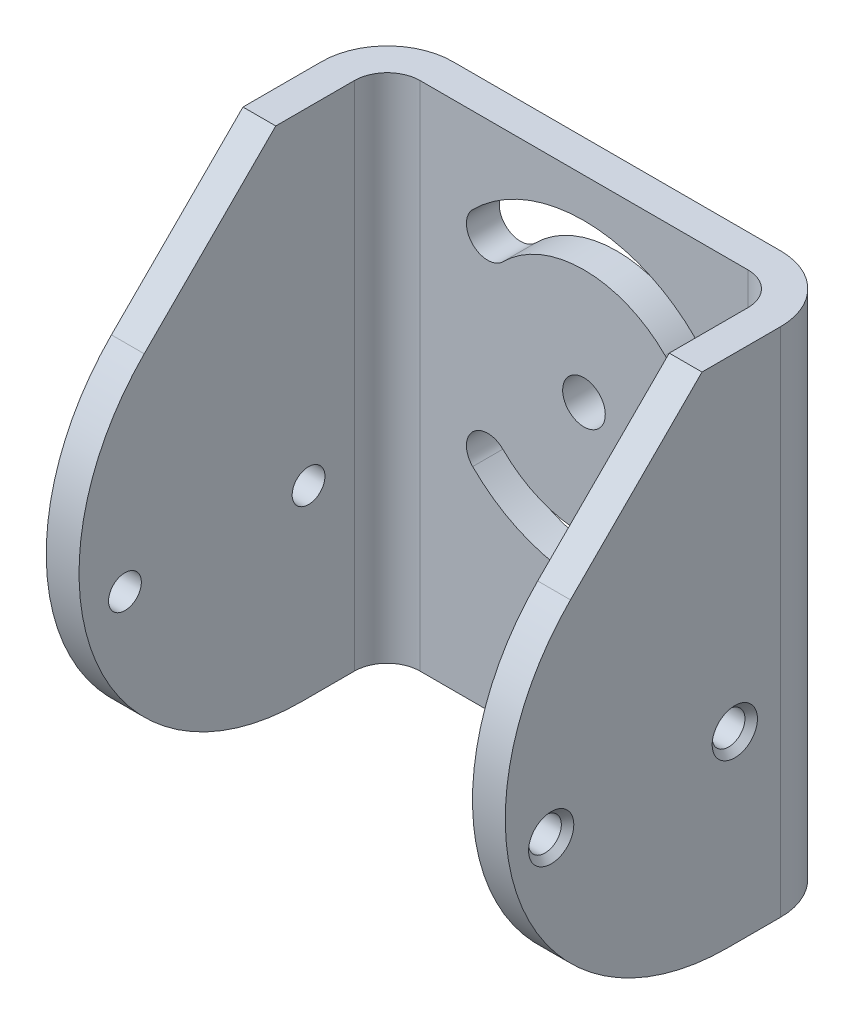
ISO-10303-21;
HEADER;
FILE_DESCRIPTION(('STEP AP214'),'2;1');
FILE_NAME('part.step','',(''),(''),'','','');
FILE_SCHEMA(('AUTOMOTIVE_DESIGN { 1 0 10303 214 1 1 1 1 }'));
ENDSEC;
DATA;
#1=APPLICATION_CONTEXT('core data for automotive mechanical design processes');
#2=APPLICATION_PROTOCOL_DEFINITION('international standard','automotive_design',2000,#1);
#3=PRODUCT_CONTEXT('',#1,'mechanical');
#4=PRODUCT('Part','Part','',(#3));
#5=PRODUCT_RELATED_PRODUCT_CATEGORY('part','',(#4));
#6=PRODUCT_DEFINITION_FORMATION('','',#4);
#7=PRODUCT_DEFINITION_CONTEXT('part definition',#1,'design');
#8=PRODUCT_DEFINITION('design','',#6,#7);
#9=PRODUCT_DEFINITION_SHAPE('','',#8);
#10=(LENGTH_UNIT() NAMED_UNIT(*) SI_UNIT(.MILLI.,.METRE.));
#11=(NAMED_UNIT(*) PLANE_ANGLE_UNIT() SI_UNIT($,.RADIAN.));
#12=(NAMED_UNIT(*) SI_UNIT($,.STERADIAN.) SOLID_ANGLE_UNIT());
#13=UNCERTAINTY_MEASURE_WITH_UNIT(LENGTH_MEASURE(1.E-05),#10,'distance_accuracy_value','');
#14=(GEOMETRIC_REPRESENTATION_CONTEXT(3) GLOBAL_UNCERTAINTY_ASSIGNED_CONTEXT((#13)) GLOBAL_UNIT_ASSIGNED_CONTEXT((#10,
#11,#12)) REPRESENTATION_CONTEXT('',''));
#15=CARTESIAN_POINT('',(0.,0.,0.));
#16=DIRECTION('',(0.,0.,1.));
#17=DIRECTION('',(1.,0.,0.));
#18=AXIS2_PLACEMENT_3D('',#15,#16,#17);
#19=CARTESIAN_POINT('',(35.0000002319239,-26.6874001927709,83.5000001813674));
#20=DIRECTION('',(1.,0.,0.));
#21=DIRECTION('',(0.,0.,-1.));
#22=AXIS2_PLACEMENT_3D('',#19,#20,#21);
#23=CYLINDRICAL_SURFACE('',#22,2.5);
#24=CARTESIAN_POINT('',(34.0500002318436,-26.6874001927709,83.5000001813674));
#25=DIRECTION('',(1.,0.,0.));
#26=DIRECTION('',(0.,-1.,0.));
#27=AXIS2_PLACEMENT_3D('',#24,#25,#26);
#28=CIRCLE('',#27,2.50000000005405);
#29=CARTESIAN_POINT('',(34.0500002318436,-29.187400192825,83.5000001813675));
#30=VERTEX_POINT('',#29);
#31=EDGE_CURVE('E286',#30,#30,#28,.T.);
#32=ORIENTED_EDGE('',*,*,#31,.T.);
#33=EDGE_LOOP('',(#32));
#34=FACE_BOUND('',#33,.T.);
#35=CARTESIAN_POINT('',(30.0000002319239,-26.6874001927709,83.5000001813674));
#36=DIRECTION('',(1.,0.,0.));
#37=DIRECTION('',(0.,0.,-1.));
#38=AXIS2_PLACEMENT_3D('',#35,#36,#37);
#39=CIRCLE('',#38,2.5);
#40=CARTESIAN_POINT('',(30.0000002319239,-26.6874001927709,81.0000001813674));
#41=VERTEX_POINT('',#40);
#42=EDGE_CURVE('E20',#41,#41,#39,.T.);
#43=ORIENTED_EDGE('',*,*,#42,.F.);
#44=EDGE_LOOP('',(#43));
#45=FACE_BOUND('',#44,.T.);
#46=ADVANCED_FACE('F17',(#34,#45),#23,.F.);
#47=CARTESIAN_POINT('',(35.0000002319239,-26.6874001927709,111.500000181367));
#48=DIRECTION('',(1.,0.,0.));
#49=DIRECTION('',(0.,0.,-1.));
#50=AXIS2_PLACEMENT_3D('',#47,#48,#49);
#51=CYLINDRICAL_SURFACE('',#50,2.5);
#52=CARTESIAN_POINT('',(34.0500002318436,-26.6874001927709,111.500000181367));
#53=DIRECTION('',(1.,0.,0.));
#54=DIRECTION('',(0.,-1.,0.));
#55=AXIS2_PLACEMENT_3D('',#52,#53,#54);
#56=CIRCLE('',#55,2.50000000005405);
#57=CARTESIAN_POINT('',(34.0500002318436,-29.187400192825,111.500000181367));
#58=VERTEX_POINT('',#57);
#59=EDGE_CURVE('E292',#58,#58,#56,.T.);
#60=ORIENTED_EDGE('',*,*,#59,.T.);
#61=EDGE_LOOP('',(#60));
#62=FACE_BOUND('',#61,.T.);
#63=CARTESIAN_POINT('',(30.0000002319239,-26.6874001927709,111.500000181367));
#64=DIRECTION('',(1.,0.,0.));
#65=DIRECTION('',(0.,0.,-1.));
#66=AXIS2_PLACEMENT_3D('',#63,#64,#65);
#67=CIRCLE('',#66,2.5);
#68=CARTESIAN_POINT('',(30.0000002319239,-26.6874001927709,109.000000181367));
#69=VERTEX_POINT('',#68);
#70=EDGE_CURVE('E153',#69,#69,#67,.T.);
#71=ORIENTED_EDGE('',*,*,#70,.F.);
#72=EDGE_LOOP('',(#71));
#73=FACE_BOUND('',#72,.T.);
#74=ADVANCED_FACE('F376',(#62,#73),#51,.F.);
#75=CARTESIAN_POINT('',(-34.9999997680761,-26.6874001927709,83.5000001813674));
#76=DIRECTION('',(-1.,0.,0.));
#77=DIRECTION('',(0.,0.,1.));
#78=AXIS2_PLACEMENT_3D('',#75,#76,#77);
#79=CYLINDRICAL_SURFACE('',#78,2.5);
#80=CARTESIAN_POINT('',(-34.0499997680581,-26.6874001927709,83.5000001813674));
#81=DIRECTION('',(-1.,0.,0.));
#82=DIRECTION('',(0.,1.,0.));
#83=AXIS2_PLACEMENT_3D('',#80,#81,#82);
#84=CIRCLE('',#83,2.4999999999414);
#85=CARTESIAN_POINT('',(-34.0499997680581,-24.1874001928295,83.5000001813673));
#86=VERTEX_POINT('',#85);
#87=EDGE_CURVE('E295',#86,#86,#84,.T.);
#88=ORIENTED_EDGE('',*,*,#87,.T.);
#89=EDGE_LOOP('',(#88));
#90=FACE_BOUND('',#89,.T.);
#91=CARTESIAN_POINT('',(-29.9999997680761,-26.6874001927709,83.5000001813674));
#92=DIRECTION('',(-1.,0.,0.));
#93=DIRECTION('',(0.,0.,1.));
#94=AXIS2_PLACEMENT_3D('',#91,#92,#93);
#95=CIRCLE('',#94,2.5);
#96=CARTESIAN_POINT('',(-29.9999997680761,-26.6874001927709,86.0000001813674));
#97=VERTEX_POINT('',#96);
#98=EDGE_CURVE('E270',#97,#97,#95,.T.);
#99=ORIENTED_EDGE('',*,*,#98,.F.);
#100=EDGE_LOOP('',(#99));
#101=FACE_BOUND('',#100,.T.);
#102=ADVANCED_FACE('F382',(#90,#101),#79,.F.);
#103=CARTESIAN_POINT('',(-34.9999997680761,-26.6874001927709,111.500000181367));
#104=DIRECTION('',(-1.,0.,0.));
#105=DIRECTION('',(0.,0.,1.));
#106=AXIS2_PLACEMENT_3D('',#103,#104,#105);
#107=CYLINDRICAL_SURFACE('',#106,2.5);
#108=CARTESIAN_POINT('',(-34.0499997680581,-26.6874001927709,111.500000181367));
#109=DIRECTION('',(-1.,0.,0.));
#110=DIRECTION('',(0.,1.,0.));
#111=AXIS2_PLACEMENT_3D('',#108,#109,#110);
#112=CIRCLE('',#111,2.4999999999414);
#113=CARTESIAN_POINT('',(-34.0499997680581,-24.1874001928295,111.500000181367));
#114=VERTEX_POINT('',#113);
#115=EDGE_CURVE('E298',#114,#114,#112,.T.);
#116=ORIENTED_EDGE('',*,*,#115,.T.);
#117=EDGE_LOOP('',(#116));
#118=FACE_BOUND('',#117,.T.);
#119=CARTESIAN_POINT('',(-29.9999997680761,-26.6874001927709,111.500000181367));
#120=DIRECTION('',(-1.,0.,0.));
#121=DIRECTION('',(0.,0.,1.));
#122=AXIS2_PLACEMENT_3D('',#119,#120,#121);
#123=CIRCLE('',#122,2.5);
#124=CARTESIAN_POINT('',(-29.9999997680761,-26.6874001927709,114.000000181367));
#125=VERTEX_POINT('',#124);
#126=EDGE_CURVE('E266',#125,#125,#123,.T.);
#127=ORIENTED_EDGE('',*,*,#126,.F.);
#128=EDGE_LOOP('',(#127));
#129=FACE_BOUND('',#128,.T.);
#130=ADVANCED_FACE('F497',(#118,#129),#107,.F.);
#131=CARTESIAN_POINT('',(-34.9999997681039,-26.6874001927709,111.500000181367));
#132=DIRECTION('',(-1.,0.,0.));
#133=DIRECTION('',(0.,0.,1.));
#134=AXIS2_PLACEMENT_3D('',#131,#132,#133);
#135=CONICAL_SURFACE('',#134,3.44999999998715,0.785398163397448);
#136=CARTESIAN_POINT('',(-34.9999997681039,-26.6874001927709,111.500000181367));
#137=DIRECTION('',(-1.,0.,0.));
#138=DIRECTION('',(0.,0.,1.));
#139=AXIS2_PLACEMENT_3D('',#136,#137,#138);
#140=CIRCLE('',#139,3.44999999998715);
#141=CARTESIAN_POINT('',(-34.9999997681039,-26.6874001927709,114.950000181354));
#142=VERTEX_POINT('',#141);
#143=EDGE_CURVE('E289',#142,#142,#140,.F.);
#144=ORIENTED_EDGE('',*,*,#143,.F.);
#145=EDGE_LOOP('',(#144));
#146=FACE_BOUND('',#145,.T.);
#147=ORIENTED_EDGE('',*,*,#115,.F.);
#148=EDGE_LOOP('',(#147));
#149=FACE_BOUND('',#148,.T.);
#150=ADVANCED_FACE('F493',(#146,#149),#135,.F.);
#151=CARTESIAN_POINT('',(-34.9999997681039,-26.6874001927709,83.5000001813674));
#152=DIRECTION('',(-1.,0.,0.));
#153=DIRECTION('',(0.,0.,1.));
#154=AXIS2_PLACEMENT_3D('',#151,#152,#153);
#155=CONICAL_SURFACE('',#154,3.44999999998715,0.785398163397448);
#156=CARTESIAN_POINT('',(-34.9999997681039,-26.6874001927709,83.5000001813674));
#157=DIRECTION('',(-1.,0.,0.));
#158=DIRECTION('',(0.,0.,1.));
#159=AXIS2_PLACEMENT_3D('',#156,#157,#158);
#160=CIRCLE('',#159,3.44999999998715);
#161=CARTESIAN_POINT('',(-34.9999997681039,-26.6874001927709,86.9500001813545));
#162=VERTEX_POINT('',#161);
#163=EDGE_CURVE('E359',#162,#162,#160,.F.);
#164=ORIENTED_EDGE('',*,*,#163,.F.);
#165=EDGE_LOOP('',(#164));
#166=FACE_BOUND('',#165,.T.);
#167=ORIENTED_EDGE('',*,*,#87,.F.);
#168=EDGE_LOOP('',(#167));
#169=FACE_BOUND('',#168,.T.);
#170=ADVANCED_FACE('F489',(#166,#169),#155,.F.);
#171=CARTESIAN_POINT('',(35.0000002317756,-26.6874001927709,111.500000181367));
#172=DIRECTION('',(1.,0.,0.));
#173=DIRECTION('',(0.,0.,-1.));
#174=AXIS2_PLACEMENT_3D('',#171,#172,#173);
#175=CONICAL_SURFACE('',#174,3.44999999998611,0.785398163397448);
#176=ORIENTED_EDGE('',*,*,#59,.F.);
#177=EDGE_LOOP('',(#176));
#178=FACE_BOUND('',#177,.T.);
#179=CARTESIAN_POINT('',(35.0000002318893,-26.6874001927709,111.500000181367));
#180=DIRECTION('',(1.,0.,0.));
#181=DIRECTION('',(0.,0.,-1.));
#182=AXIS2_PLACEMENT_3D('',#179,#180,#181);
#183=CIRCLE('',#182,3.4500000000998);
#184=CARTESIAN_POINT('',(35.0000002318893,-26.6874001927709,108.050000181267));
#185=VERTEX_POINT('',#184);
#186=EDGE_CURVE('E251',#185,#185,#183,.F.);
#187=ORIENTED_EDGE('',*,*,#186,.F.);
#188=EDGE_LOOP('',(#187));
#189=FACE_BOUND('',#188,.T.);
#190=ADVANCED_FACE('F485',(#178,#189),#175,.F.);
#191=CARTESIAN_POINT('',(35.0000002317756,-26.6874001927709,83.5000001813674));
#192=DIRECTION('',(1.,0.,0.));
#193=DIRECTION('',(0.,0.,-1.));
#194=AXIS2_PLACEMENT_3D('',#191,#192,#193);
#195=CONICAL_SURFACE('',#194,3.44999999998611,0.785398163397448);
#196=ORIENTED_EDGE('',*,*,#31,.F.);
#197=EDGE_LOOP('',(#196));
#198=FACE_BOUND('',#197,.T.);
#199=CARTESIAN_POINT('',(35.0000002318893,-26.6874001927709,83.5000001813674));
#200=DIRECTION('',(1.,0.,0.));
#201=DIRECTION('',(0.,0.,-1.));
#202=AXIS2_PLACEMENT_3D('',#199,#200,#201);
#203=CIRCLE('',#202,3.4500000000998);
#204=CARTESIAN_POINT('',(35.0000002318893,-26.6874001927709,80.0500001812676));
#205=VERTEX_POINT('',#204);
#206=EDGE_CURVE('E244',#205,#205,#203,.F.);
#207=ORIENTED_EDGE('',*,*,#206,.F.);
#208=EDGE_LOOP('',(#207));
#209=FACE_BOUND('',#208,.T.);
#210=ADVANCED_FACE('F481',(#198,#209),#195,.F.);
#211=CARTESIAN_POINT('',(-32.4999997680761,8.31259980722917,103.500000181367));
#212=DIRECTION('',(0.,0.707106781186564,0.707106781186531));
#213=DIRECTION('',(0.,-0.707106781186531,0.707106781186564));
#214=AXIS2_PLACEMENT_3D('',#211,#212,#213);
#215=PLANE('',#214);
#216=DIRECTION('',(1.,0.,0.));
#217=VECTOR('',#216,1.);
#218=CARTESIAN_POINT('',(-39.9999997680761,23.3125998072288,88.5000001813665));
#219=LINE('',#218,#217);
#220=CARTESIAN_POINT('',(-34.9999997680761,23.3125998072288,88.5000001813665));
#221=VERTEX_POINT('',#220);
#222=CARTESIAN_POINT('',(-29.9999997680761,23.3125998072287,88.5000001813666));
#223=VERTEX_POINT('',#222);
#224=EDGE_CURVE('E197',#221,#223,#219,.T.);
#225=ORIENTED_EDGE('',*,*,#224,.F.);
#226=DIRECTION('',(0.,0.707106781186527,-0.707106781186568));
#227=VECTOR('',#226,1.);
#228=CARTESIAN_POINT('',(-34.9999997680761,3.25372530418349,108.558874684413));
#229=LINE('',#228,#227);
#230=CARTESIAN_POINT('',(-34.9999997680761,3.2537253041836,108.558874684413));
#231=VERTEX_POINT('',#230);
#232=EDGE_CURVE('E248',#231,#221,#229,.T.);
#233=ORIENTED_EDGE('',*,*,#232,.F.);
#234=DIRECTION('',(-1.,0.,0.));
#235=VECTOR('',#234,1.);
#236=CARTESIAN_POINT('',(-34.9999997680761,3.25372530418336,108.558874684413));
#237=LINE('',#236,#235);
#238=CARTESIAN_POINT('',(-29.9999997680761,3.25372530418361,108.558874684413));
#239=VERTEX_POINT('',#238);
#240=EDGE_CURVE('E287',#239,#231,#237,.T.);
#241=ORIENTED_EDGE('',*,*,#240,.F.);
#242=DIRECTION('',(0.,-0.707106781186527,0.707106781186568));
#243=VECTOR('',#242,1.);
#244=CARTESIAN_POINT('',(-29.9999997680761,23.3125998072288,88.5000001813665));
#245=LINE('',#244,#243);
#246=EDGE_CURVE('E259',#223,#239,#245,.T.);
#247=ORIENTED_EDGE('',*,*,#246,.F.);
#248=EDGE_LOOP('',(#225,#233,#241,#247));
#249=FACE_BOUND('',#248,.T.);
#250=ADVANCED_FACE('F477',(#249),#215,.T.);
#251=CARTESIAN_POINT('',(32.5000002319239,8.31259980722917,103.500000181367));
#252=DIRECTION('',(0.,0.707106781186564,0.707106781186531));
#253=DIRECTION('',(0.,-0.707106781186531,0.707106781186564));
#254=AXIS2_PLACEMENT_3D('',#251,#252,#253);
#255=PLANE('',#254);
#256=DIRECTION('',(1.,0.,0.));
#257=VECTOR('',#256,1.);
#258=CARTESIAN_POINT('',(-39.9999997680761,23.3125998072288,88.5000001813665));
#259=LINE('',#258,#257);
#260=CARTESIAN_POINT('',(30.0000002319239,23.3125998072288,88.5000001813665));
#261=VERTEX_POINT('',#260);
#262=CARTESIAN_POINT('',(35.0000002319239,23.3125998072287,88.5000001813666));
#263=VERTEX_POINT('',#262);
#264=EDGE_CURVE('E181',#261,#263,#259,.T.);
#265=ORIENTED_EDGE('',*,*,#264,.F.);
#266=DIRECTION('',(0.,0.707106781186526,-0.707106781186569));
#267=VECTOR('',#266,1.);
#268=CARTESIAN_POINT('',(30.0000002319239,3.25372530418349,108.558874684413));
#269=LINE('',#268,#267);
#270=CARTESIAN_POINT('',(30.0000002319239,3.25372530418363,108.558874684413));
#271=VERTEX_POINT('',#270);
#272=EDGE_CURVE('E152',#271,#261,#269,.T.);
#273=ORIENTED_EDGE('',*,*,#272,.F.);
#274=DIRECTION('',(-1.,0.,0.));
#275=VECTOR('',#274,1.);
#276=CARTESIAN_POINT('',(-34.9999997680761,3.2537253041834,108.558874684413));
#277=LINE('',#276,#275);
#278=CARTESIAN_POINT('',(35.0000002319239,3.25372530418368,108.558874684413));
#279=VERTEX_POINT('',#278);
#280=EDGE_CURVE('E148',#279,#271,#277,.T.);
#281=ORIENTED_EDGE('',*,*,#280,.F.);
#282=DIRECTION('',(0.,-0.707106781186525,0.70710678118657));
#283=VECTOR('',#282,1.);
#284=CARTESIAN_POINT('',(35.0000002319239,23.3125998072288,88.5000001813665));
#285=LINE('',#284,#283);
#286=EDGE_CURVE('E241',#263,#279,#285,.T.);
#287=ORIENTED_EDGE('',*,*,#286,.F.);
#288=EDGE_LOOP('',(#265,#273,#281,#287));
#289=FACE_BOUND('',#288,.T.);
#290=ADVANCED_FACE('F474',(#289),#255,.T.);
#291=CARTESIAN_POINT('',(-34.9999997680761,-20.746274695817,84.5588746844132));
#292=DIRECTION('',(-1.,0.,0.));
#293=DIRECTION('',(0.,0.,1.));
#294=AXIS2_PLACEMENT_3D('',#291,#292,#293);
#295=CYLINDRICAL_SURFACE('',#294,33.9411254969543);
#296=CARTESIAN_POINT('',(30.0000002319239,-20.746274695817,84.5588746844132));
#297=DIRECTION('',(-1.,0.,0.));
#298=DIRECTION('',(0.,0.,1.));
#299=AXIS2_PLACEMENT_3D('',#296,#297,#298);
#300=CIRCLE('',#299,33.9411254969543);
#301=CARTESIAN_POINT('',(30.0000002319239,-54.6874001927713,84.5588746844137));
#302=VERTEX_POINT('',#301);
#303=EDGE_CURVE('E145',#302,#271,#300,.T.);
#304=ORIENTED_EDGE('',*,*,#303,.F.);
#305=DIRECTION('',(1.,0.,0.));
#306=VECTOR('',#305,1.);
#307=CARTESIAN_POINT('',(40.0000002319239,-54.6874001927713,84.5588746844135));
#308=LINE('',#307,#306);
#309=CARTESIAN_POINT('',(35.0000002319239,-54.6874001927713,84.5588746844137));
#310=VERTEX_POINT('',#309);
#311=EDGE_CURVE('E132',#310,#302,#308,.F.);
#312=ORIENTED_EDGE('',*,*,#311,.F.);
#313=CARTESIAN_POINT('',(35.0000002319239,-20.746274695817,84.5588746844132));
#314=DIRECTION('',(-1.,0.,0.));
#315=DIRECTION('',(0.,0.,1.));
#316=AXIS2_PLACEMENT_3D('',#313,#314,#315);
#317=CIRCLE('',#316,33.9411254969543);
#318=EDGE_CURVE('E243',#279,#310,#317,.F.);
#319=ORIENTED_EDGE('',*,*,#318,.F.);
#320=ORIENTED_EDGE('',*,*,#280,.T.);
#321=EDGE_LOOP('',(#304,#312,#319,#320));
#322=FACE_BOUND('',#321,.T.);
#323=ADVANCED_FACE('F146',(#322),#295,.T.);
#324=CARTESIAN_POINT('',(30.0000002319239,-46.6874001927716,71.5000001813681));
#325=DIRECTION('',(-1.,0.,0.));
#326=DIRECTION('',(0.,0.,1.));
#327=AXIS2_PLACEMENT_3D('',#324,#325,#326);
#328=PLANE('',#327);
#329=ORIENTED_EDGE('',*,*,#272,.T.);
#330=DIRECTION('',(0.,0.,1.));
#331=VECTOR('',#330,1.);
#332=CARTESIAN_POINT('',(30.0000002319239,23.3125998072283,66.5000001813665));
#333=LINE('',#332,#331);
#334=CARTESIAN_POINT('',(30.0000002319239,23.3125998072285,76.5000001813665));
#335=VERTEX_POINT('',#334);
#336=EDGE_CURVE('E184',#335,#261,#333,.T.);
#337=ORIENTED_EDGE('',*,*,#336,.F.);
#338=DIRECTION('',(0.,-1.,0.));
#339=VECTOR('',#338,1.);
#340=CARTESIAN_POINT('',(30.0000002319239,19.7587662931992,76.5000001813666));
#341=LINE('',#340,#339);
#342=CARTESIAN_POINT('',(30.0000002319239,-54.6874001927714,76.5000001813683));
#343=VERTEX_POINT('',#342);
#344=EDGE_CURVE('E158',#335,#343,#341,.T.);
#345=ORIENTED_EDGE('',*,*,#344,.T.);
#346=DIRECTION('',(0.,0.,-1.));
#347=VECTOR('',#346,1.);
#348=CARTESIAN_POINT('',(30.0000002319239,-54.6874001927717,66.5000001813683));
#349=LINE('',#348,#347);
#350=EDGE_CURVE('E136',#302,#343,#349,.T.);
#351=ORIENTED_EDGE('',*,*,#350,.F.);
#352=ORIENTED_EDGE('',*,*,#303,.T.);
#353=EDGE_LOOP('',(#329,#337,#345,#351,#352));
#354=FACE_BOUND('',#353,.T.);
#355=ORIENTED_EDGE('',*,*,#70,.T.);
#356=EDGE_LOOP('',(#355));
#357=FACE_BOUND('',#356,.T.);
#358=ORIENTED_EDGE('',*,*,#42,.T.);
#359=EDGE_LOOP('',(#358));
#360=FACE_BOUND('',#359,.T.);
#361=ADVANCED_FACE('F155',(#354,#357,#360),#328,.T.);
#362=CARTESIAN_POINT('',(25.0000002319239,19.7587662931992,76.5000001813666));
#363=DIRECTION('',(0.,-1.,0.));
#364=DIRECTION('',(0.,0.,-1.));
#365=AXIS2_PLACEMENT_3D('',#362,#363,#364);
#366=CYLINDRICAL_SURFACE('',#365,5.);
#367=CARTESIAN_POINT('',(25.0000002319239,-54.6874001927714,76.5000001813683));
#368=DIRECTION('',(0.,-1.,0.));
#369=DIRECTION('',(0.,0.,-1.));
#370=AXIS2_PLACEMENT_3D('',#367,#368,#369);
#371=CIRCLE('',#370,5.);
#372=CARTESIAN_POINT('',(25.0000002319239,-54.6874001927716,71.5000001813682));
#373=VERTEX_POINT('',#372);
#374=EDGE_CURVE('E160',#343,#373,#371,.F.);
#375=ORIENTED_EDGE('',*,*,#374,.F.);
#376=ORIENTED_EDGE('',*,*,#344,.F.);
#377=CARTESIAN_POINT('',(25.0000002319239,23.3125998072285,76.5000001813665));
#378=DIRECTION('',(0.,-1.,0.));
#379=DIRECTION('',(0.,0.,-1.));
#380=AXIS2_PLACEMENT_3D('',#377,#378,#379);
#381=CIRCLE('',#380,5.);
#382=CARTESIAN_POINT('',(25.0000002319239,23.3125998072284,71.5000001813665));
#383=VERTEX_POINT('',#382);
#384=EDGE_CURVE('E187',#383,#335,#381,.T.);
#385=ORIENTED_EDGE('',*,*,#384,.F.);
#386=DIRECTION('',(0.,-1.,0.));
#387=VECTOR('',#386,1.);
#388=CARTESIAN_POINT('',(25.0000002319239,2.72541331255883,71.5000001813669));
#389=LINE('',#388,#387);
#390=EDGE_CURVE('E271',#373,#383,#389,.F.);
#391=ORIENTED_EDGE('',*,*,#390,.F.);
#392=EDGE_LOOP('',(#375,#376,#385,#391));
#393=FACE_BOUND('',#392,.T.);
#394=ADVANCED_FACE('F465',(#393),#366,.F.);
#395=CARTESIAN_POINT('',(16.382976663996,2.72541331255883,71.5000001813669));
#396=DIRECTION('',(0.,0.,1.));
#397=DIRECTION('',(0.,-1.,0.));
#398=AXIS2_PLACEMENT_3D('',#395,#396,#397);
#399=PLANE('',#398);
#400=DIRECTION('',(0.,1.,0.));
#401=VECTOR('',#400,1.);
#402=CARTESIAN_POINT('',(-24.9999997680761,19.7587662931991,71.5000001813666));
#403=LINE('',#402,#401);
#404=CARTESIAN_POINT('',(-24.9999997680761,23.3125998072284,71.5000001813665));
#405=VERTEX_POINT('',#404);
#406=CARTESIAN_POINT('',(-24.9999997680761,-54.6874001927716,71.5000001813683));
#407=VERTEX_POINT('',#406);
#408=EDGE_CURVE('E267',#405,#407,#403,.F.);
#409=ORIENTED_EDGE('',*,*,#408,.T.);
#410=DIRECTION('',(1.,0.,0.));
#411=VECTOR('',#410,1.);
#412=CARTESIAN_POINT('',(40.0000002319239,-54.6874001927716,71.5000001813683));
#413=LINE('',#412,#411);
#414=EDGE_CURVE('E162',#373,#407,#413,.F.);
#415=ORIENTED_EDGE('',*,*,#414,.F.);
#416=ORIENTED_EDGE('',*,*,#390,.T.);
#417=DIRECTION('',(1.,0.,0.));
#418=VECTOR('',#417,1.);
#419=CARTESIAN_POINT('',(-39.9999997680761,23.3125998072284,71.5000001813665));
#420=LINE('',#419,#418);
#421=EDGE_CURVE('E190',#405,#383,#420,.T.);
#422=ORIENTED_EDGE('',*,*,#421,.F.);
#423=EDGE_LOOP('',(#409,#415,#416,#422));
#424=FACE_BOUND('',#423,.T.);
#425=CARTESIAN_POINT('',(2.31923896976127E-07,-6.68740019277157,71.5000001813672));
#426=DIRECTION('',(0.,0.,1.));
#427=DIRECTION('',(0.,-1.,0.));
#428=AXIS2_PLACEMENT_3D('',#425,#426,#427);
#429=CIRCLE('',#428,24.);
#430=CARTESIAN_POINT('',(16.9705629804011,-23.6579629412487,71.5000001813676));
#431=VERTEX_POINT('',#430);
#432=CARTESIAN_POINT('',(-16.9705625165533,-23.6579629412487,71.5000001813676));
#433=VERTEX_POINT('',#432);
#434=EDGE_CURVE('E237',#431,#433,#429,.F.);
#435=ORIENTED_EDGE('',*,*,#434,.T.);
#436=CARTESIAN_POINT('',(-14.672465477697,-21.3598659023924,71.5000001813675));
#437=DIRECTION('',(0.,0.,1.));
#438=DIRECTION('',(0.,-1.,0.));
#439=AXIS2_PLACEMENT_3D('',#436,#437,#438);
#440=CIRCLE('',#439,3.25);
#441=CARTESIAN_POINT('',(-12.3743684388407,-19.0617688635361,71.5000001813675));
#442=VERTEX_POINT('',#441);
#443=EDGE_CURVE('E236',#433,#442,#440,.F.);
#444=ORIENTED_EDGE('',*,*,#443,.T.);
#445=CARTESIAN_POINT('',(2.31923896976127E-07,-6.68740019277157,71.5000001813672));
#446=DIRECTION('',(0.,0.,1.));
#447=DIRECTION('',(0.,-1.,0.));
#448=AXIS2_PLACEMENT_3D('',#445,#446,#447);
#449=CIRCLE('',#448,17.5);
#450=CARTESIAN_POINT('',(12.3743689026885,-19.0617688635361,71.5000001813675));
#451=VERTEX_POINT('',#450);
#452=EDGE_CURVE('E232',#451,#442,#449,.F.);
#453=ORIENTED_EDGE('',*,*,#452,.F.);
#454=CARTESIAN_POINT('',(14.6724659415448,-21.3598659023924,71.5000001813676));
#455=DIRECTION('',(0.,0.,1.));
#456=DIRECTION('',(0.,-1.,0.));
#457=AXIS2_PLACEMENT_3D('',#454,#455,#456);
#458=CIRCLE('',#457,3.25);
#459=EDGE_CURVE('E225',#451,#431,#458,.F.);
#460=ORIENTED_EDGE('',*,*,#459,.T.);
#461=EDGE_LOOP('',(#435,#444,#453,#460));
#462=FACE_BOUND('',#461,.T.);
#463=CARTESIAN_POINT('',(14.6724659415448,7.98506551684929,71.5000001813669));
#464=DIRECTION('',(0.,0.,1.));
#465=DIRECTION('',(0.,-1.,0.));
#466=AXIS2_PLACEMENT_3D('',#463,#464,#465);
#467=CIRCLE('',#466,3.25);
#468=CARTESIAN_POINT('',(16.970562980401,10.2831625557056,71.5000001813668));
#469=VERTEX_POINT('',#468);
#470=CARTESIAN_POINT('',(12.3743689026885,5.68696847799301,71.5000001813669));
#471=VERTEX_POINT('',#470);
#472=EDGE_CURVE('E209',#469,#471,#467,.F.);
#473=ORIENTED_EDGE('',*,*,#472,.T.);
#474=CARTESIAN_POINT('',(2.31923896976127E-07,-6.68740019277157,71.5000001813672));
#475=DIRECTION('',(0.,0.,1.));
#476=DIRECTION('',(0.,-1.,0.));
#477=AXIS2_PLACEMENT_3D('',#474,#475,#476);
#478=CIRCLE('',#477,17.5);
#479=CARTESIAN_POINT('',(-12.3743684388407,5.68696847799302,71.5000001813669));
#480=VERTEX_POINT('',#479);
#481=EDGE_CURVE('E221',#480,#471,#478,.F.);
#482=ORIENTED_EDGE('',*,*,#481,.F.);
#483=CARTESIAN_POINT('',(-14.672465477697,7.9850655168493,71.5000001813668));
#484=DIRECTION('',(0.,0.,1.));
#485=DIRECTION('',(0.,-1.,0.));
#486=AXIS2_PLACEMENT_3D('',#483,#484,#485);
#487=CIRCLE('',#486,3.25);
#488=CARTESIAN_POINT('',(-16.9705625165532,10.2831625557056,71.5000001813668));
#489=VERTEX_POINT('',#488);
#490=EDGE_CURVE('E217',#480,#489,#487,.F.);
#491=ORIENTED_EDGE('',*,*,#490,.T.);
#492=CARTESIAN_POINT('',(2.31923896976127E-07,-6.68740019277157,71.5000001813672));
#493=DIRECTION('',(0.,0.,1.));
#494=DIRECTION('',(0.,-1.,0.));
#495=AXIS2_PLACEMENT_3D('',#492,#493,#494);
#496=CIRCLE('',#495,24.);
#497=EDGE_CURVE('E213',#489,#469,#496,.F.);
#498=ORIENTED_EDGE('',*,*,#497,.T.);
#499=EDGE_LOOP('',(#473,#482,#491,#498));
#500=FACE_BOUND('',#499,.T.);
#501=CARTESIAN_POINT('',(2.31923905857911E-07,-6.68740019277156,71.5000001813672));
#502=DIRECTION('',(0.,0.,1.));
#503=DIRECTION('',(0.,-1.,0.));
#504=AXIS2_PLACEMENT_3D('',#501,#502,#503);
#505=CIRCLE('',#504,3.25);
#506=CARTESIAN_POINT('',(2.31923905857911E-07,-9.93740019277156,71.5000001813672));
#507=VERTEX_POINT('',#506);
#508=EDGE_CURVE('E203',#507,#507,#505,.F.);
#509=ORIENTED_EDGE('',*,*,#508,.T.);
#510=EDGE_LOOP('',(#509));
#511=FACE_BOUND('',#510,.T.);
#512=ADVANCED_FACE('F461',(#424,#462,#500,#511),#399,.T.);
#513=CARTESIAN_POINT('',(-24.9999997680761,19.7587662931992,76.5000001813666));
#514=DIRECTION('',(0.,1.,0.));
#515=DIRECTION('',(0.,0.,1.));
#516=AXIS2_PLACEMENT_3D('',#513,#514,#515);
#517=CYLINDRICAL_SURFACE('',#516,5.);
#518=CARTESIAN_POINT('',(-24.9999997680761,23.3125998072286,76.5000001813665));
#519=DIRECTION('',(0.,1.,0.));
#520=DIRECTION('',(0.,0.,1.));
#521=AXIS2_PLACEMENT_3D('',#518,#519,#520);
#522=CIRCLE('',#521,5.);
#523=CARTESIAN_POINT('',(-29.9999997680761,23.3125998072286,76.5000001813674));
#524=VERTEX_POINT('',#523);
#525=EDGE_CURVE('E193',#524,#405,#522,.F.);
#526=ORIENTED_EDGE('',*,*,#525,.F.);
#527=DIRECTION('',(0.,1.,0.));
#528=VECTOR('',#527,1.);
#529=CARTESIAN_POINT('',(-29.9999997680761,33.3125998072284,76.5000001813683));
#530=LINE('',#529,#528);
#531=CARTESIAN_POINT('',(-29.9999997680761,-54.6874001927715,76.5000001813683));
#532=VERTEX_POINT('',#531);
#533=EDGE_CURVE('E262',#532,#524,#530,.T.);
#534=ORIENTED_EDGE('',*,*,#533,.F.);
#535=CARTESIAN_POINT('',(-24.9999997680761,-54.6874001927715,76.5000001813683));
#536=DIRECTION('',(0.,1.,0.));
#537=DIRECTION('',(0.,0.,1.));
#538=AXIS2_PLACEMENT_3D('',#535,#536,#537);
#539=CIRCLE('',#538,5.);
#540=EDGE_CURVE('E332',#407,#532,#539,.T.);
#541=ORIENTED_EDGE('',*,*,#540,.F.);
#542=ORIENTED_EDGE('',*,*,#408,.F.);
#543=EDGE_LOOP('',(#526,#534,#541,#542));
#544=FACE_BOUND('',#543,.T.);
#545=ADVANCED_FACE('F457',(#544),#517,.F.);
#546=CARTESIAN_POINT('',(-29.9999997680761,33.3125998072284,71.5000001813662));
#547=DIRECTION('',(1.,0.,0.));
#548=DIRECTION('',(0.,0.,-1.));
#549=AXIS2_PLACEMENT_3D('',#546,#547,#548);
#550=PLANE('',#549);
#551=CARTESIAN_POINT('',(-29.9999997680761,-20.746274695817,84.5588746844132));
#552=DIRECTION('',(-1.,0.,0.));
#553=DIRECTION('',(0.,0.,1.));
#554=AXIS2_PLACEMENT_3D('',#551,#552,#553);
#555=CIRCLE('',#554,33.9411254969543);
#556=CARTESIAN_POINT('',(-29.9999997680761,-54.6874001927713,84.5588746844137));
#557=VERTEX_POINT('',#556);
#558=EDGE_CURVE('E261',#557,#239,#555,.T.);
#559=ORIENTED_EDGE('',*,*,#558,.F.);
#560=DIRECTION('',(0.,0.,-1.));
#561=VECTOR('',#560,1.);
#562=CARTESIAN_POINT('',(-29.9999997680761,-54.6874001927717,66.5000001813683));
#563=LINE('',#562,#561);
#564=EDGE_CURVE('E258',#532,#557,#563,.F.);
#565=ORIENTED_EDGE('',*,*,#564,.F.);
#566=ORIENTED_EDGE('',*,*,#533,.T.);
#567=DIRECTION('',(0.,0.,1.));
#568=VECTOR('',#567,1.);
#569=CARTESIAN_POINT('',(-29.9999997680761,23.3125998072283,66.5000001813665));
#570=LINE('',#569,#568);
#571=EDGE_CURVE('E194',#223,#524,#570,.F.);
#572=ORIENTED_EDGE('',*,*,#571,.F.);
#573=ORIENTED_EDGE('',*,*,#246,.T.);
#574=EDGE_LOOP('',(#559,#565,#566,#572,#573));
#575=FACE_BOUND('',#574,.T.);
#576=ORIENTED_EDGE('',*,*,#126,.T.);
#577=EDGE_LOOP('',(#576));
#578=FACE_BOUND('',#577,.T.);
#579=ORIENTED_EDGE('',*,*,#98,.T.);
#580=EDGE_LOOP('',(#579));
#581=FACE_BOUND('',#580,.T.);
#582=ADVANCED_FACE('F453',(#575,#578,#581),#550,.T.);
#583=CARTESIAN_POINT('',(-34.9999997680761,-20.746274695817,84.5588746844132));
#584=DIRECTION('',(-1.,0.,0.));
#585=DIRECTION('',(0.,0.,1.));
#586=AXIS2_PLACEMENT_3D('',#583,#584,#585);
#587=CYLINDRICAL_SURFACE('',#586,33.9411254969543);
#588=CARTESIAN_POINT('',(-34.9999997680761,-20.746274695817,84.5588746844132));
#589=DIRECTION('',(-1.,0.,0.));
#590=DIRECTION('',(0.,0.,1.));
#591=AXIS2_PLACEMENT_3D('',#588,#589,#590);
#592=CIRCLE('',#591,33.9411254969543);
#593=CARTESIAN_POINT('',(-34.9999997680761,-54.6874001927713,84.5588746844137));
#594=VERTEX_POINT('',#593);
#595=EDGE_CURVE('E252',#594,#231,#592,.T.);
#596=ORIENTED_EDGE('',*,*,#595,.F.);
#597=DIRECTION('',(1.,0.,0.));
#598=VECTOR('',#597,1.);
#599=CARTESIAN_POINT('',(40.0000002319239,-54.6874001927713,84.5588746844135));
#600=LINE('',#599,#598);
#601=EDGE_CURVE('E255',#557,#594,#600,.F.);
#602=ORIENTED_EDGE('',*,*,#601,.F.);
#603=ORIENTED_EDGE('',*,*,#558,.T.);
#604=ORIENTED_EDGE('',*,*,#240,.T.);
#605=EDGE_LOOP('',(#596,#602,#603,#604));
#606=FACE_BOUND('',#605,.T.);
#607=ADVANCED_FACE('F449',(#606),#587,.T.);
#608=CARTESIAN_POINT('',(-34.9999997680761,-46.6874001927717,66.5000001813681));
#609=DIRECTION('',(-1.,0.,0.));
#610=DIRECTION('',(0.,0.,1.));
#611=AXIS2_PLACEMENT_3D('',#608,#609,#610);
#612=PLANE('',#611);
#613=ORIENTED_EDGE('',*,*,#232,.T.);
#614=DIRECTION('',(0.,0.,1.));
#615=VECTOR('',#614,1.);
#616=CARTESIAN_POINT('',(-34.9999997680761,23.3125998072283,66.5000001813665));
#617=LINE('',#616,#615);
#618=CARTESIAN_POINT('',(-34.9999997680761,23.3125998072286,76.5000001813665));
#619=VERTEX_POINT('',#618);
#620=EDGE_CURVE('E200',#619,#221,#617,.T.);
#621=ORIENTED_EDGE('',*,*,#620,.F.);
#622=DIRECTION('',(0.,-1.,0.));
#623=VECTOR('',#622,1.);
#624=CARTESIAN_POINT('',(-34.9999997680761,19.7587662931992,76.5000001813666));
#625=LINE('',#624,#623);
#626=CARTESIAN_POINT('',(-34.9999997680761,-54.6874001927715,76.5000001813683));
#627=VERTEX_POINT('',#626);
#628=EDGE_CURVE('E180',#627,#619,#625,.F.);
#629=ORIENTED_EDGE('',*,*,#628,.F.);
#630=DIRECTION('',(0.,0.,-1.));
#631=VECTOR('',#630,1.);
#632=CARTESIAN_POINT('',(-34.9999997680761,-54.6874001927717,66.5000001813683));
#633=LINE('',#632,#631);
#634=EDGE_CURVE('E257',#594,#627,#633,.T.);
#635=ORIENTED_EDGE('',*,*,#634,.F.);
#636=ORIENTED_EDGE('',*,*,#595,.T.);
#637=EDGE_LOOP('',(#613,#621,#629,#635,#636));
#638=FACE_BOUND('',#637,.T.);
#639=ORIENTED_EDGE('',*,*,#163,.T.);
#640=EDGE_LOOP('',(#639));
#641=FACE_BOUND('',#640,.T.);
#642=ORIENTED_EDGE('',*,*,#143,.T.);
#643=EDGE_LOOP('',(#642));
#644=FACE_BOUND('',#643,.T.);
#645=ADVANCED_FACE('F445',(#638,#641,#644),#612,.T.);
#646=CARTESIAN_POINT('',(35.0000002319239,33.3125998072284,71.5000001813662));
#647=DIRECTION('',(1.,0.,0.));
#648=DIRECTION('',(0.,0.,-1.));
#649=AXIS2_PLACEMENT_3D('',#646,#647,#648);
#650=PLANE('',#649);
#651=DIRECTION('',(0.,0.,-1.));
#652=VECTOR('',#651,1.);
#653=CARTESIAN_POINT('',(35.0000002319239,-54.6874001927717,66.5000001813683));
#654=LINE('',#653,#652);
#655=CARTESIAN_POINT('',(35.0000002319239,-54.6874001927714,76.5000001813683));
#656=VERTEX_POINT('',#655);
#657=EDGE_CURVE('E139',#656,#310,#654,.F.);
#658=ORIENTED_EDGE('',*,*,#657,.F.);
#659=DIRECTION('',(0.,1.,0.));
#660=VECTOR('',#659,1.);
#661=CARTESIAN_POINT('',(35.0000002319239,19.7587662931992,76.5000001813666));
#662=LINE('',#661,#660);
#663=CARTESIAN_POINT('',(35.0000002319239,23.3125998072285,76.5000001813665));
#664=VERTEX_POINT('',#663);
#665=EDGE_CURVE('E238',#664,#656,#662,.F.);
#666=ORIENTED_EDGE('',*,*,#665,.F.);
#667=DIRECTION('',(0.,0.,1.));
#668=VECTOR('',#667,1.);
#669=CARTESIAN_POINT('',(35.0000002319239,23.3125998072283,66.5000001813665));
#670=LINE('',#669,#668);
#671=EDGE_CURVE('E178',#263,#664,#670,.F.);
#672=ORIENTED_EDGE('',*,*,#671,.F.);
#673=ORIENTED_EDGE('',*,*,#286,.T.);
#674=ORIENTED_EDGE('',*,*,#318,.T.);
#675=EDGE_LOOP('',(#658,#666,#672,#673,#674));
#676=FACE_BOUND('',#675,.T.);
#677=ORIENTED_EDGE('',*,*,#206,.T.);
#678=EDGE_LOOP('',(#677));
#679=FACE_BOUND('',#678,.T.);
#680=ORIENTED_EDGE('',*,*,#186,.T.);
#681=EDGE_LOOP('',(#680));
#682=FACE_BOUND('',#681,.T.);
#683=ADVANCED_FACE('F441',(#676,#679,#682),#650,.T.);
#684=CARTESIAN_POINT('',(2.31923896976127E-07,-6.68740019277157,71.5000001813672));
#685=DIRECTION('',(0.,0.,1.));
#686=DIRECTION('',(0.,-1.,0.));
#687=AXIS2_PLACEMENT_3D('',#684,#685,#686);
#688=CYLINDRICAL_SURFACE('',#687,24.);
#689=DIRECTION('',(0.,0.,1.));
#690=VECTOR('',#689,1.);
#691=CARTESIAN_POINT('',(-16.9705625165532,-23.6579629412487,71.5000001813676));
#692=LINE('',#691,#690);
#693=CARTESIAN_POINT('',(-16.9705625165533,-23.6579629412488,66.5000001813676));
#694=VERTEX_POINT('',#693);
#695=EDGE_CURVE('E233',#694,#433,#692,.T.);
#696=ORIENTED_EDGE('',*,*,#695,.T.);
#697=ORIENTED_EDGE('',*,*,#434,.F.);
#698=DIRECTION('',(0.,0.,1.));
#699=VECTOR('',#698,1.);
#700=CARTESIAN_POINT('',(16.970562980401,-23.6579629412487,71.5000001813676));
#701=LINE('',#700,#699);
#702=CARTESIAN_POINT('',(16.9705629804011,-23.6579629412488,66.5000001813676));
#703=VERTEX_POINT('',#702);
#704=EDGE_CURVE('E222',#431,#703,#701,.F.);
#705=ORIENTED_EDGE('',*,*,#704,.T.);
#706=CARTESIAN_POINT('',(2.31923896976127E-07,-6.68740019277168,66.5000001813672));
#707=DIRECTION('',(0.,0.,1.));
#708=DIRECTION('',(0.,-1.,0.));
#709=AXIS2_PLACEMENT_3D('',#706,#707,#708);
#710=CIRCLE('',#709,24.);
#711=EDGE_CURVE('E324',#703,#694,#710,.F.);
#712=ORIENTED_EDGE('',*,*,#711,.T.);
#713=EDGE_LOOP('',(#696,#697,#705,#712));
#714=FACE_BOUND('',#713,.T.);
#715=ADVANCED_FACE('F437',(#714),#688,.F.);
#716=CARTESIAN_POINT('',(-14.672465477697,-21.3598659023924,71.5000001813675));
#717=DIRECTION('',(0.,0.,1.));
#718=DIRECTION('',(0.,-1.,0.));
#719=AXIS2_PLACEMENT_3D('',#716,#717,#718);
#720=CYLINDRICAL_SURFACE('',#719,3.25);
#721=DIRECTION('',(0.,0.,1.));
#722=VECTOR('',#721,1.);
#723=CARTESIAN_POINT('',(-12.3743684388407,-19.0617688635361,71.5000001813675));
#724=LINE('',#723,#722);
#725=CARTESIAN_POINT('',(-12.3743684388407,-19.0617688635362,66.5000001813675));
#726=VERTEX_POINT('',#725);
#727=EDGE_CURVE('E229',#442,#726,#724,.F.);
#728=ORIENTED_EDGE('',*,*,#727,.F.);
#729=ORIENTED_EDGE('',*,*,#443,.F.);
#730=ORIENTED_EDGE('',*,*,#695,.F.);
#731=CARTESIAN_POINT('',(-14.672465477697,-21.3598659023925,66.5000001813676));
#732=DIRECTION('',(0.,0.,1.));
#733=DIRECTION('',(0.,-1.,0.));
#734=AXIS2_PLACEMENT_3D('',#731,#732,#733);
#735=CIRCLE('',#734,3.25);
#736=EDGE_CURVE('E321',#694,#726,#735,.F.);
#737=ORIENTED_EDGE('',*,*,#736,.T.);
#738=EDGE_LOOP('',(#728,#729,#730,#737));
#739=FACE_BOUND('',#738,.T.);
#740=ADVANCED_FACE('F433',(#739),#720,.F.);
#741=CARTESIAN_POINT('',(2.31923896976127E-07,-6.68740019277157,71.5000001813672));
#742=DIRECTION('',(0.,0.,1.));
#743=DIRECTION('',(0.,-1.,0.));
#744=AXIS2_PLACEMENT_3D('',#741,#742,#743);
#745=CYLINDRICAL_SURFACE('',#744,17.5);
#746=ORIENTED_EDGE('',*,*,#452,.T.);
#747=ORIENTED_EDGE('',*,*,#727,.T.);
#748=CARTESIAN_POINT('',(2.31923896976127E-07,-6.68740019277168,66.5000001813672));
#749=DIRECTION('',(0.,0.,1.));
#750=DIRECTION('',(0.,-1.,0.));
#751=AXIS2_PLACEMENT_3D('',#748,#749,#750);
#752=CIRCLE('',#751,17.5);
#753=CARTESIAN_POINT('',(12.3743689026885,-19.0617688635363,66.5000001813675));
#754=VERTEX_POINT('',#753);
#755=EDGE_CURVE('E318',#726,#754,#752,.T.);
#756=ORIENTED_EDGE('',*,*,#755,.T.);
#757=DIRECTION('',(0.,0.,1.));
#758=VECTOR('',#757,1.);
#759=CARTESIAN_POINT('',(12.3743689026885,-19.0617688635362,71.5000001813674));
#760=LINE('',#759,#758);
#761=EDGE_CURVE('E226',#754,#451,#760,.T.);
#762=ORIENTED_EDGE('',*,*,#761,.T.);
#763=EDGE_LOOP('',(#746,#747,#756,#762));
#764=FACE_BOUND('',#763,.T.);
#765=ADVANCED_FACE('F429',(#764),#745,.T.);
#766=CARTESIAN_POINT('',(14.6724659415448,-21.3598659023924,71.5000001813675));
#767=DIRECTION('',(0.,0.,1.));
#768=DIRECTION('',(0.,-1.,0.));
#769=AXIS2_PLACEMENT_3D('',#766,#767,#768);
#770=CYLINDRICAL_SURFACE('',#769,3.25);
#771=ORIENTED_EDGE('',*,*,#704,.F.);
#772=ORIENTED_EDGE('',*,*,#459,.F.);
#773=ORIENTED_EDGE('',*,*,#761,.F.);
#774=CARTESIAN_POINT('',(14.6724659415448,-21.3598659023925,66.5000001813675));
#775=DIRECTION('',(0.,0.,1.));
#776=DIRECTION('',(0.,-1.,0.));
#777=AXIS2_PLACEMENT_3D('',#774,#775,#776);
#778=CIRCLE('',#777,3.25);
#779=EDGE_CURVE('E315',#754,#703,#778,.F.);
#780=ORIENTED_EDGE('',*,*,#779,.T.);
#781=EDGE_LOOP('',(#771,#772,#773,#780));
#782=FACE_BOUND('',#781,.T.);
#783=ADVANCED_FACE('F425',(#782),#770,.F.);
#784=CARTESIAN_POINT('',(2.31923896976127E-07,-6.68740019277157,71.5000001813672));
#785=DIRECTION('',(0.,0.,1.));
#786=DIRECTION('',(0.,-1.,0.));
#787=AXIS2_PLACEMENT_3D('',#784,#785,#786);
#788=CYLINDRICAL_SURFACE('',#787,17.5);
#789=ORIENTED_EDGE('',*,*,#481,.T.);
#790=DIRECTION('',(0.,0.,1.));
#791=VECTOR('',#790,1.);
#792=CARTESIAN_POINT('',(12.3743689026885,5.68696847799302,71.5000001813669));
#793=LINE('',#792,#791);
#794=CARTESIAN_POINT('',(12.3743689026885,5.68696847799289,66.5000001813669));
#795=VERTEX_POINT('',#794);
#796=EDGE_CURVE('E206',#471,#795,#793,.F.);
#797=ORIENTED_EDGE('',*,*,#796,.T.);
#798=CARTESIAN_POINT('',(2.31923896976127E-07,-6.68740019277168,66.5000001813672));
#799=DIRECTION('',(0.,0.,1.));
#800=DIRECTION('',(0.,-1.,0.));
#801=AXIS2_PLACEMENT_3D('',#798,#799,#800);
#802=CIRCLE('',#801,17.5);
#803=CARTESIAN_POINT('',(-12.3743684388407,5.68696847799291,66.5000001813669));
#804=VERTEX_POINT('',#803);
#805=EDGE_CURVE('E312',#795,#804,#802,.T.);
#806=ORIENTED_EDGE('',*,*,#805,.T.);
#807=DIRECTION('',(0.,0.,1.));
#808=VECTOR('',#807,1.);
#809=CARTESIAN_POINT('',(-12.3743684388407,5.68696847799303,71.5000001813669));
#810=LINE('',#809,#808);
#811=EDGE_CURVE('E218',#804,#480,#810,.T.);
#812=ORIENTED_EDGE('',*,*,#811,.T.);
#813=EDGE_LOOP('',(#789,#797,#806,#812));
#814=FACE_BOUND('',#813,.T.);
#815=ADVANCED_FACE('F421',(#814),#788,.T.);
#816=CARTESIAN_POINT('',(-14.672465477697,7.9850655168493,71.5000001813668));
#817=DIRECTION('',(0.,0.,1.));
#818=DIRECTION('',(0.,-1.,0.));
#819=AXIS2_PLACEMENT_3D('',#816,#817,#818);
#820=CYLINDRICAL_SURFACE('',#819,3.25);
#821=DIRECTION('',(0.,0.,1.));
#822=VECTOR('',#821,1.);
#823=CARTESIAN_POINT('',(-16.9705625165532,10.2831625557056,71.5000001813668));
#824=LINE('',#823,#822);
#825=CARTESIAN_POINT('',(-16.9705625165532,10.2831625557055,66.5000001813668));
#826=VERTEX_POINT('',#825);
#827=EDGE_CURVE('E214',#826,#489,#824,.T.);
#828=ORIENTED_EDGE('',*,*,#827,.T.);
#829=ORIENTED_EDGE('',*,*,#490,.F.);
#830=ORIENTED_EDGE('',*,*,#811,.F.);
#831=CARTESIAN_POINT('',(-14.672465477697,7.98506551684919,66.5000001813669));
#832=DIRECTION('',(0.,0.,1.));
#833=DIRECTION('',(0.,-1.,0.));
#834=AXIS2_PLACEMENT_3D('',#831,#832,#833);
#835=CIRCLE('',#834,3.25);
#836=EDGE_CURVE('E309',#804,#826,#835,.F.);
#837=ORIENTED_EDGE('',*,*,#836,.T.);
#838=EDGE_LOOP('',(#828,#829,#830,#837));
#839=FACE_BOUND('',#838,.T.);
#840=ADVANCED_FACE('F417',(#839),#820,.F.);
#841=CARTESIAN_POINT('',(2.31923896976127E-07,-6.68740019277157,71.5000001813672));
#842=DIRECTION('',(0.,0.,1.));
#843=DIRECTION('',(0.,-1.,0.));
#844=AXIS2_PLACEMENT_3D('',#841,#842,#843);
#845=CYLINDRICAL_SURFACE('',#844,24.);
#846=DIRECTION('',(0.,0.,1.));
#847=VECTOR('',#846,1.);
#848=CARTESIAN_POINT('',(16.970562980401,10.2831625557056,71.5000001813667));
#849=LINE('',#848,#847);
#850=CARTESIAN_POINT('',(16.9705629804011,10.2831625557055,66.5000001813668));
#851=VERTEX_POINT('',#850);
#852=EDGE_CURVE('E210',#851,#469,#849,.T.);
#853=ORIENTED_EDGE('',*,*,#852,.T.);
#854=ORIENTED_EDGE('',*,*,#497,.F.);
#855=ORIENTED_EDGE('',*,*,#827,.F.);
#856=CARTESIAN_POINT('',(2.31923896976127E-07,-6.68740019277168,66.5000001813672));
#857=DIRECTION('',(0.,0.,1.));
#858=DIRECTION('',(0.,-1.,0.));
#859=AXIS2_PLACEMENT_3D('',#856,#857,#858);
#860=CIRCLE('',#859,24.);
#861=EDGE_CURVE('E306',#826,#851,#860,.F.);
#862=ORIENTED_EDGE('',*,*,#861,.T.);
#863=EDGE_LOOP('',(#853,#854,#855,#862));
#864=FACE_BOUND('',#863,.T.);
#865=ADVANCED_FACE('F413',(#864),#845,.F.);
#866=CARTESIAN_POINT('',(14.6724659415448,7.98506551684929,71.5000001813668));
#867=DIRECTION('',(0.,0.,1.));
#868=DIRECTION('',(0.,-1.,0.));
#869=AXIS2_PLACEMENT_3D('',#866,#867,#868);
#870=CYLINDRICAL_SURFACE('',#869,3.25);
#871=ORIENTED_EDGE('',*,*,#796,.F.);
#872=ORIENTED_EDGE('',*,*,#472,.F.);
#873=ORIENTED_EDGE('',*,*,#852,.F.);
#874=CARTESIAN_POINT('',(14.6724659415448,7.98506551684918,66.5000001813668));
#875=DIRECTION('',(0.,0.,1.));
#876=DIRECTION('',(0.,-1.,0.));
#877=AXIS2_PLACEMENT_3D('',#874,#875,#876);
#878=CIRCLE('',#877,3.25);
#879=EDGE_CURVE('E303',#851,#795,#878,.F.);
#880=ORIENTED_EDGE('',*,*,#879,.T.);
#881=EDGE_LOOP('',(#871,#872,#873,#880));
#882=FACE_BOUND('',#881,.T.);
#883=ADVANCED_FACE('F409',(#882),#870,.F.);
#884=CARTESIAN_POINT('',(2.31923905857911E-07,-6.68740019277156,71.5000001813672));
#885=DIRECTION('',(0.,0.,1.));
#886=DIRECTION('',(0.,-1.,0.));
#887=AXIS2_PLACEMENT_3D('',#884,#885,#886);
#888=CYLINDRICAL_SURFACE('',#887,3.25);
#889=CARTESIAN_POINT('',(2.31923905857911E-07,-6.68740019277167,66.5000001813672));
#890=DIRECTION('',(0.,0.,1.));
#891=DIRECTION('',(0.,-1.,0.));
#892=AXIS2_PLACEMENT_3D('',#889,#890,#891);
#893=CIRCLE('',#892,3.25);
#894=CARTESIAN_POINT('',(2.31923905857911E-07,-9.93740019277167,66.5000001813672));
#895=VERTEX_POINT('',#894);
#896=EDGE_CURVE('E177',#895,#895,#893,.F.);
#897=ORIENTED_EDGE('',*,*,#896,.T.);
#898=EDGE_LOOP('',(#897));
#899=FACE_BOUND('',#898,.T.);
#900=ORIENTED_EDGE('',*,*,#508,.F.);
#901=EDGE_LOOP('',(#900));
#902=FACE_BOUND('',#901,.T.);
#903=ADVANCED_FACE('F405',(#899,#902),#888,.F.);
#904=CARTESIAN_POINT('',(-39.9999997680761,23.3125998072283,66.5000001813665));
#905=DIRECTION('',(0.,1.,0.));
#906=DIRECTION('',(0.,0.,1.));
#907=AXIS2_PLACEMENT_3D('',#904,#905,#906);
#908=PLANE('',#907);
#909=ORIENTED_EDGE('',*,*,#671,.T.);
#910=CARTESIAN_POINT('',(25.0000002319239,23.3125998072285,76.5000001813665));
#911=DIRECTION('',(0.,1.,0.));
#912=DIRECTION('',(0.,0.,1.));
#913=AXIS2_PLACEMENT_3D('',#910,#911,#912);
#914=CIRCLE('',#913,10.);
#915=CARTESIAN_POINT('',(25.0000002319239,23.3125998072283,66.5000001813665));
#916=VERTEX_POINT('',#915);
#917=EDGE_CURVE('E240',#916,#664,#914,.F.);
#918=ORIENTED_EDGE('',*,*,#917,.F.);
#919=DIRECTION('',(1.,0.,0.));
#920=VECTOR('',#919,1.);
#921=CARTESIAN_POINT('',(11.1931672965648,23.3125998072283,66.5000001813665));
#922=LINE('',#921,#920);
#923=CARTESIAN_POINT('',(-24.9999997680761,23.3125998072283,66.5000001813665));
#924=VERTEX_POINT('',#923);
#925=EDGE_CURVE('E172',#916,#924,#922,.F.);
#926=ORIENTED_EDGE('',*,*,#925,.T.);
#927=CARTESIAN_POINT('',(-24.9999997680761,23.3125998072286,76.5000001813665));
#928=DIRECTION('',(0.,-1.,0.));
#929=DIRECTION('',(0.,0.,-1.));
#930=AXIS2_PLACEMENT_3D('',#927,#928,#929);
#931=CIRCLE('',#930,10.);
#932=EDGE_CURVE('E168',#619,#924,#931,.T.);
#933=ORIENTED_EDGE('',*,*,#932,.F.);
#934=ORIENTED_EDGE('',*,*,#620,.T.);
#935=ORIENTED_EDGE('',*,*,#224,.T.);
#936=ORIENTED_EDGE('',*,*,#571,.T.);
#937=ORIENTED_EDGE('',*,*,#525,.T.);
#938=ORIENTED_EDGE('',*,*,#421,.T.);
#939=ORIENTED_EDGE('',*,*,#384,.T.);
#940=ORIENTED_EDGE('',*,*,#336,.T.);
#941=ORIENTED_EDGE('',*,*,#264,.T.);
#942=EDGE_LOOP('',(#909,#918,#926,#933,#934,#935,#936,#937,#938,#939,#940,#941));
#943=FACE_BOUND('',#942,.T.);
#944=ADVANCED_FACE('F401',(#943),#908,.T.);
#945=CARTESIAN_POINT('',(-24.9999997680761,19.7587662931992,76.5000001813666));
#946=DIRECTION('',(0.,-1.,0.));
#947=DIRECTION('',(0.,0.,-1.));
#948=AXIS2_PLACEMENT_3D('',#945,#946,#947);
#949=CYLINDRICAL_SURFACE('',#948,10.);
#950=ORIENTED_EDGE('',*,*,#628,.T.);
#951=ORIENTED_EDGE('',*,*,#932,.T.);
#952=DIRECTION('',(0.,-1.,0.));
#953=VECTOR('',#952,1.);
#954=CARTESIAN_POINT('',(-24.9999997680761,19.758766293199,66.5000001813666));
#955=LINE('',#954,#953);
#956=CARTESIAN_POINT('',(-24.9999997680761,-54.6874001927717,66.5000001813683));
#957=VERTEX_POINT('',#956);
#958=EDGE_CURVE('E169',#924,#957,#955,.T.);
#959=ORIENTED_EDGE('',*,*,#958,.T.);
#960=CARTESIAN_POINT('',(-24.9999997680761,-54.6874001927715,76.5000001813683));
#961=DIRECTION('',(0.,-1.,0.));
#962=DIRECTION('',(0.,0.,-1.));
#963=AXIS2_PLACEMENT_3D('',#960,#961,#962);
#964=CIRCLE('',#963,10.);
#965=EDGE_CURVE('E330',#627,#957,#964,.T.);
#966=ORIENTED_EDGE('',*,*,#965,.F.);
#967=EDGE_LOOP('',(#950,#951,#959,#966));
#968=FACE_BOUND('',#967,.T.);
#969=ADVANCED_FACE('F398',(#968),#949,.T.);
#970=CARTESIAN_POINT('',(40.0000002319239,-54.6874001927717,66.5000001813683));
#971=DIRECTION('',(0.,-1.,0.));
#972=DIRECTION('',(0.,0.,-1.));
#973=AXIS2_PLACEMENT_3D('',#970,#971,#972);
#974=PLANE('',#973);
#975=ORIENTED_EDGE('',*,*,#634,.T.);
#976=ORIENTED_EDGE('',*,*,#965,.T.);
#977=DIRECTION('',(1.,0.,0.));
#978=VECTOR('',#977,1.);
#979=CARTESIAN_POINT('',(11.1931672965648,-54.6874001927717,66.5000001813683));
#980=LINE('',#979,#978);
#981=CARTESIAN_POINT('',(25.0000002319239,-54.6874001927717,66.5000001813683));
#982=VERTEX_POINT('',#981);
#983=EDGE_CURVE('E26',#957,#982,#980,.T.);
#984=ORIENTED_EDGE('',*,*,#983,.T.);
#985=CARTESIAN_POINT('',(25.0000002319239,-54.6874001927714,76.5000001813683));
#986=DIRECTION('',(0.,1.,0.));
#987=DIRECTION('',(0.,0.,1.));
#988=AXIS2_PLACEMENT_3D('',#985,#986,#987);
#989=CIRCLE('',#988,10.);
#990=EDGE_CURVE('E34',#656,#982,#989,.T.);
#991=ORIENTED_EDGE('',*,*,#990,.F.);
#992=ORIENTED_EDGE('',*,*,#657,.T.);
#993=ORIENTED_EDGE('',*,*,#311,.T.);
#994=ORIENTED_EDGE('',*,*,#350,.T.);
#995=ORIENTED_EDGE('',*,*,#374,.T.);
#996=ORIENTED_EDGE('',*,*,#414,.T.);
#997=ORIENTED_EDGE('',*,*,#540,.T.);
#998=ORIENTED_EDGE('',*,*,#564,.T.);
#999=ORIENTED_EDGE('',*,*,#601,.T.);
#1000=EDGE_LOOP('',(#975,#976,#984,#991,#992,#993,#994,#995,#996,#997,#998,#999));
#1001=FACE_BOUND('',#1000,.T.);
#1002=ADVANCED_FACE('F134',(#1001),#974,.T.);
#1003=CARTESIAN_POINT('',(25.0000002319239,19.7587662931992,76.5000001813666));
#1004=DIRECTION('',(0.,1.,0.));
#1005=DIRECTION('',(0.,0.,1.));
#1006=AXIS2_PLACEMENT_3D('',#1003,#1004,#1005);
#1007=CYLINDRICAL_SURFACE('',#1006,10.);
#1008=ORIENTED_EDGE('',*,*,#665,.T.);
#1009=ORIENTED_EDGE('',*,*,#990,.T.);
#1010=DIRECTION('',(0.,-1.,0.));
#1011=VECTOR('',#1010,1.);
#1012=CARTESIAN_POINT('',(25.0000002319239,19.758766293199,66.5000001813666));
#1013=LINE('',#1012,#1011);
#1014=EDGE_CURVE('E11',#982,#916,#1013,.F.);
#1015=ORIENTED_EDGE('',*,*,#1014,.T.);
#1016=ORIENTED_EDGE('',*,*,#917,.T.);
#1017=EDGE_LOOP('',(#1008,#1009,#1015,#1016));
#1018=FACE_BOUND('',#1017,.T.);
#1019=ADVANCED_FACE('F386',(#1018),#1007,.T.);
#1020=CARTESIAN_POINT('',(11.1931672965648,19.758766293199,66.5000001813666));
#1021=DIRECTION('',(0.,0.,1.));
#1022=DIRECTION('',(0.,-1.,0.));
#1023=AXIS2_PLACEMENT_3D('',#1020,#1021,#1022);
#1024=PLANE('',#1023);
#1025=ORIENTED_EDGE('',*,*,#983,.F.);
#1026=ORIENTED_EDGE('',*,*,#958,.F.);
#1027=ORIENTED_EDGE('',*,*,#925,.F.);
#1028=ORIENTED_EDGE('',*,*,#1014,.F.);
#1029=EDGE_LOOP('',(#1025,#1026,#1027,#1028));
#1030=FACE_BOUND('',#1029,.T.);
#1031=ORIENTED_EDGE('',*,*,#896,.F.);
#1032=EDGE_LOOP('',(#1031));
#1033=FACE_BOUND('',#1032,.T.);
#1034=ORIENTED_EDGE('',*,*,#861,.F.);
#1035=ORIENTED_EDGE('',*,*,#836,.F.);
#1036=ORIENTED_EDGE('',*,*,#805,.F.);
#1037=ORIENTED_EDGE('',*,*,#879,.F.);
#1038=EDGE_LOOP('',(#1034,#1035,#1036,#1037));
#1039=FACE_BOUND('',#1038,.T.);
#1040=ORIENTED_EDGE('',*,*,#755,.F.);
#1041=ORIENTED_EDGE('',*,*,#736,.F.);
#1042=ORIENTED_EDGE('',*,*,#711,.F.);
#1043=ORIENTED_EDGE('',*,*,#779,.F.);
#1044=EDGE_LOOP('',(#1040,#1041,#1042,#1043));
#1045=FACE_BOUND('',#1044,.T.);
#1046=ADVANCED_FACE('F384',(#1030,#1033,#1039,#1045),#1024,.F.);
#1047=CLOSED_SHELL('',(#46,#74,#102,#130,#150,#170,#190,#210,#250,#290,#323,#361,#394,#512,#545,
#582,#607,#645,#683,#715,#740,#765,#783,#815,#840,#865,#883,#903,#944,#969,#1002,#1019,#1046));
#1048=MANIFOLD_SOLID_BREP('B1',#1047);
#1049=ADVANCED_BREP_SHAPE_REPRESENTATION('',(#18,#1048),#14);
#1050=SHAPE_DEFINITION_REPRESENTATION(#9,#1049);
ENDSEC;
END-ISO-10303-21;
